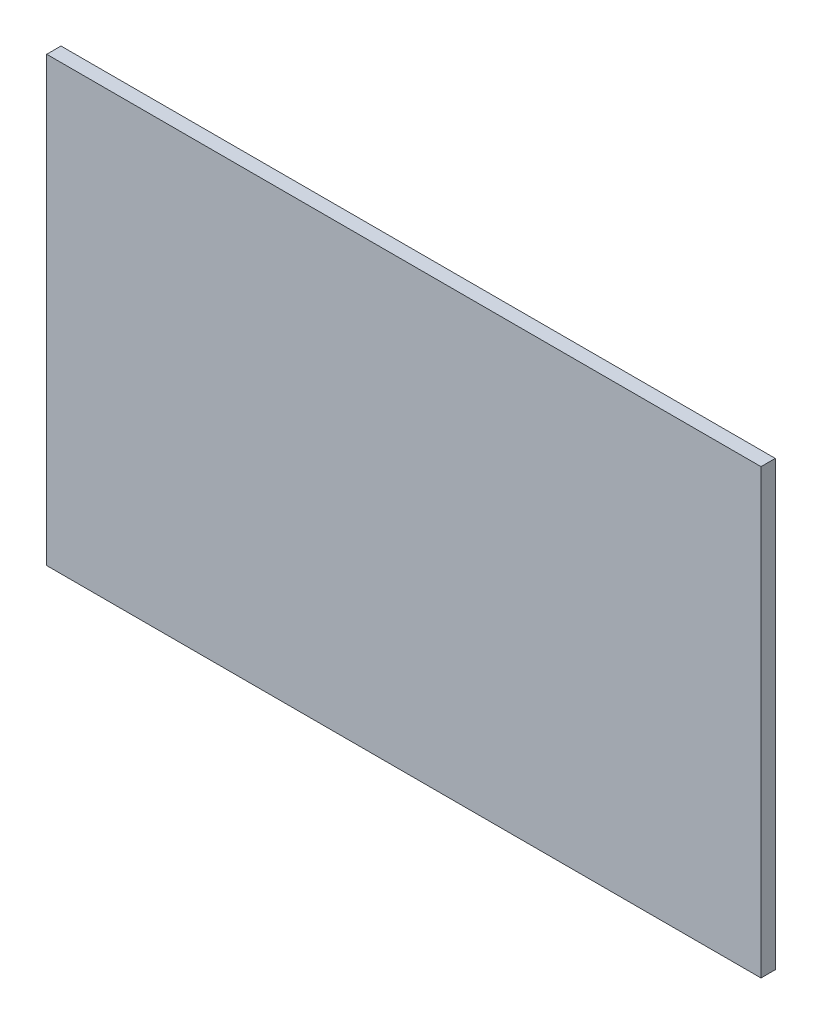
ISO-10303-21;
HEADER;
FILE_DESCRIPTION(('STEP AP214'),'2;1');
FILE_NAME('part.step','',(''),(''),'','','');
FILE_SCHEMA(('AUTOMOTIVE_DESIGN { 1 0 10303 214 1 1 1 1 }'));
ENDSEC;
DATA;
#1=APPLICATION_CONTEXT('core data for automotive mechanical design processes');
#2=APPLICATION_PROTOCOL_DEFINITION('international standard','automotive_design',2000,#1);
#3=PRODUCT_CONTEXT('',#1,'mechanical');
#4=PRODUCT('Part','Part','',(#3));
#5=PRODUCT_RELATED_PRODUCT_CATEGORY('part','',(#4));
#6=PRODUCT_DEFINITION_FORMATION('','',#4);
#7=PRODUCT_DEFINITION_CONTEXT('part definition',#1,'design');
#8=PRODUCT_DEFINITION('design','',#6,#7);
#9=PRODUCT_DEFINITION_SHAPE('','',#8);
#10=(LENGTH_UNIT() NAMED_UNIT(*) SI_UNIT(.MILLI.,.METRE.));
#11=(NAMED_UNIT(*) PLANE_ANGLE_UNIT() SI_UNIT($,.RADIAN.));
#12=(NAMED_UNIT(*) SI_UNIT($,.STERADIAN.) SOLID_ANGLE_UNIT());
#13=UNCERTAINTY_MEASURE_WITH_UNIT(LENGTH_MEASURE(1.E-05),#10,'distance_accuracy_value','');
#14=(GEOMETRIC_REPRESENTATION_CONTEXT(3) GLOBAL_UNCERTAINTY_ASSIGNED_CONTEXT((#13)) GLOBAL_UNIT_ASSIGNED_CONTEXT((#10,
#11,#12)) REPRESENTATION_CONTEXT('',''));
#15=CARTESIAN_POINT('',(0.,0.,0.));
#16=DIRECTION('',(0.,0.,1.));
#17=DIRECTION('',(1.,0.,0.));
#18=AXIS2_PLACEMENT_3D('',#15,#16,#17);
#19=CARTESIAN_POINT('',(250.,155.,10.));
#20=DIRECTION('',(-1.,0.,0.));
#21=DIRECTION('',(0.,0.,1.));
#22=AXIS2_PLACEMENT_3D('',#19,#20,#21);
#23=PLANE('',#22);
#24=DIRECTION('',(0.,1.,0.));
#25=VECTOR('',#24,1.);
#26=CARTESIAN_POINT('',(250.,155.,0.));
#27=LINE('',#26,#25);
#28=CARTESIAN_POINT('',(250.,-155.,0.));
#29=VERTEX_POINT('',#28);
#30=CARTESIAN_POINT('',(250.,155.,0.));
#31=VERTEX_POINT('',#30);
#32=EDGE_CURVE('E96',#29,#31,#27,.T.);
#33=ORIENTED_EDGE('',*,*,#32,.T.);
#34=DIRECTION('',(0.,0.,-1.));
#35=VECTOR('',#34,1.);
#36=CARTESIAN_POINT('',(250.,155.,10.));
#37=LINE('',#36,#35);
#38=CARTESIAN_POINT('',(250.,155.,10.));
#39=VERTEX_POINT('',#38);
#40=EDGE_CURVE('E11',#39,#31,#37,.T.);
#41=ORIENTED_EDGE('',*,*,#40,.F.);
#42=DIRECTION('',(0.,1.,0.));
#43=VECTOR('',#42,1.);
#44=CARTESIAN_POINT('',(250.,155.,10.));
#45=LINE('',#44,#43);
#46=CARTESIAN_POINT('',(250.,-155.,10.));
#47=VERTEX_POINT('',#46);
#48=EDGE_CURVE('E84',#47,#39,#45,.T.);
#49=ORIENTED_EDGE('',*,*,#48,.F.);
#50=DIRECTION('',(0.,0.,-1.));
#51=VECTOR('',#50,1.);
#52=CARTESIAN_POINT('',(250.,-155.,10.));
#53=LINE('',#52,#51);
#54=EDGE_CURVE('E92',#47,#29,#53,.T.);
#55=ORIENTED_EDGE('',*,*,#54,.T.);
#56=EDGE_LOOP('',(#33,#41,#49,#55));
#57=FACE_BOUND('',#56,.T.);
#58=ADVANCED_FACE('F33',(#57),#23,.F.);
#59=CARTESIAN_POINT('',(-250.,155.,10.));
#60=DIRECTION('',(0.,-1.,0.));
#61=DIRECTION('',(0.,0.,-1.));
#62=AXIS2_PLACEMENT_3D('',#59,#60,#61);
#63=PLANE('',#62);
#64=DIRECTION('',(-1.,0.,0.));
#65=VECTOR('',#64,1.);
#66=CARTESIAN_POINT('',(-250.,155.,0.));
#67=LINE('',#66,#65);
#68=CARTESIAN_POINT('',(-250.,155.,0.));
#69=VERTEX_POINT('',#68);
#70=EDGE_CURVE('E88',#31,#69,#67,.T.);
#71=ORIENTED_EDGE('',*,*,#70,.T.);
#72=DIRECTION('',(0.,0.,-1.));
#73=VECTOR('',#72,1.);
#74=CARTESIAN_POINT('',(-250.,155.,10.));
#75=LINE('',#74,#73);
#76=CARTESIAN_POINT('',(-250.,155.,10.));
#77=VERTEX_POINT('',#76);
#78=EDGE_CURVE('E41',#77,#69,#75,.T.);
#79=ORIENTED_EDGE('',*,*,#78,.F.);
#80=DIRECTION('',(-1.,0.,0.));
#81=VECTOR('',#80,1.);
#82=CARTESIAN_POINT('',(-250.,155.,10.));
#83=LINE('',#82,#81);
#84=EDGE_CURVE('E79',#39,#77,#83,.T.);
#85=ORIENTED_EDGE('',*,*,#84,.F.);
#86=ORIENTED_EDGE('',*,*,#40,.T.);
#87=EDGE_LOOP('',(#71,#79,#85,#86));
#88=FACE_BOUND('',#87,.T.);
#89=ADVANCED_FACE('F87',(#88),#63,.F.);
#90=CARTESIAN_POINT('',(-250.,155.,10.));
#91=DIRECTION('',(1.,0.,0.));
#92=DIRECTION('',(0.,1.,0.));
#93=AXIS2_PLACEMENT_3D('',#90,#91,#92);
#94=PLANE('',#93);
#95=DIRECTION('',(0.,-1.,0.));
#96=VECTOR('',#95,1.);
#97=CARTESIAN_POINT('',(-250.,155.,0.));
#98=LINE('',#97,#96);
#99=CARTESIAN_POINT('',(-250.,-155.,0.));
#100=VERTEX_POINT('',#99);
#101=EDGE_CURVE('E66',#69,#100,#98,.T.);
#102=ORIENTED_EDGE('',*,*,#101,.T.);
#103=DIRECTION('',(0.,0.,-1.));
#104=VECTOR('',#103,1.);
#105=CARTESIAN_POINT('',(-250.,-155.,10.));
#106=LINE('',#105,#104);
#107=CARTESIAN_POINT('',(-250.,-155.,10.));
#108=VERTEX_POINT('',#107);
#109=EDGE_CURVE('E89',#108,#100,#106,.T.);
#110=ORIENTED_EDGE('',*,*,#109,.F.);
#111=DIRECTION('',(0.,-1.,0.));
#112=VECTOR('',#111,1.);
#113=CARTESIAN_POINT('',(-250.,155.,10.));
#114=LINE('',#113,#112);
#115=EDGE_CURVE('E82',#77,#108,#114,.T.);
#116=ORIENTED_EDGE('',*,*,#115,.F.);
#117=ORIENTED_EDGE('',*,*,#78,.T.);
#118=EDGE_LOOP('',(#102,#110,#116,#117));
#119=FACE_BOUND('',#118,.T.);
#120=ADVANCED_FACE('F90',(#119),#94,.F.);
#121=CARTESIAN_POINT('',(-250.,-155.,10.));
#122=DIRECTION('',(0.,1.,0.));
#123=DIRECTION('',(0.,0.,1.));
#124=AXIS2_PLACEMENT_3D('',#121,#122,#123);
#125=PLANE('',#124);
#126=DIRECTION('',(1.,0.,0.));
#127=VECTOR('',#126,1.);
#128=CARTESIAN_POINT('',(-250.,-155.,0.));
#129=LINE('',#128,#127);
#130=EDGE_CURVE('E72',#100,#29,#129,.T.);
#131=ORIENTED_EDGE('',*,*,#130,.T.);
#132=ORIENTED_EDGE('',*,*,#54,.F.);
#133=DIRECTION('',(1.,0.,0.));
#134=VECTOR('',#133,1.);
#135=CARTESIAN_POINT('',(-250.,-155.,10.));
#136=LINE('',#135,#134);
#137=EDGE_CURVE('E49',#108,#47,#136,.T.);
#138=ORIENTED_EDGE('',*,*,#137,.F.);
#139=ORIENTED_EDGE('',*,*,#109,.T.);
#140=EDGE_LOOP('',(#131,#132,#138,#139));
#141=FACE_BOUND('',#140,.T.);
#142=ADVANCED_FACE('F103',(#141),#125,.F.);
#143=CARTESIAN_POINT('',(0.,0.,10.));
#144=DIRECTION('',(0.,0.,1.));
#145=DIRECTION('',(1.,0.,0.));
#146=AXIS2_PLACEMENT_3D('',#143,#144,#145);
#147=PLANE('',#146);
#148=ORIENTED_EDGE('',*,*,#48,.T.);
#149=ORIENTED_EDGE('',*,*,#84,.T.);
#150=ORIENTED_EDGE('',*,*,#115,.T.);
#151=ORIENTED_EDGE('',*,*,#137,.T.);
#152=EDGE_LOOP('',(#148,#149,#150,#151));
#153=FACE_BOUND('',#152,.T.);
#154=ADVANCED_FACE('F80',(#153),#147,.T.);
#155=CARTESIAN_POINT('',(0.,0.,0.));
#156=DIRECTION('',(0.,0.,1.));
#157=DIRECTION('',(1.,0.,0.));
#158=AXIS2_PLACEMENT_3D('',#155,#156,#157);
#159=PLANE('',#158);
#160=ORIENTED_EDGE('',*,*,#32,.F.);
#161=ORIENTED_EDGE('',*,*,#130,.F.);
#162=ORIENTED_EDGE('',*,*,#101,.F.);
#163=ORIENTED_EDGE('',*,*,#70,.F.);
#164=EDGE_LOOP('',(#160,#161,#162,#163));
#165=FACE_BOUND('',#164,.T.);
#166=ADVANCED_FACE('F106',(#165),#159,.F.);
#167=CLOSED_SHELL('',(#58,#89,#120,#142,#154,#166));
#168=MANIFOLD_SOLID_BREP('B2',#167);
#169=ADVANCED_BREP_SHAPE_REPRESENTATION('',(#18,#168),#14);
#170=SHAPE_DEFINITION_REPRESENTATION(#9,#169);
ENDSEC;
END-ISO-10303-21;
